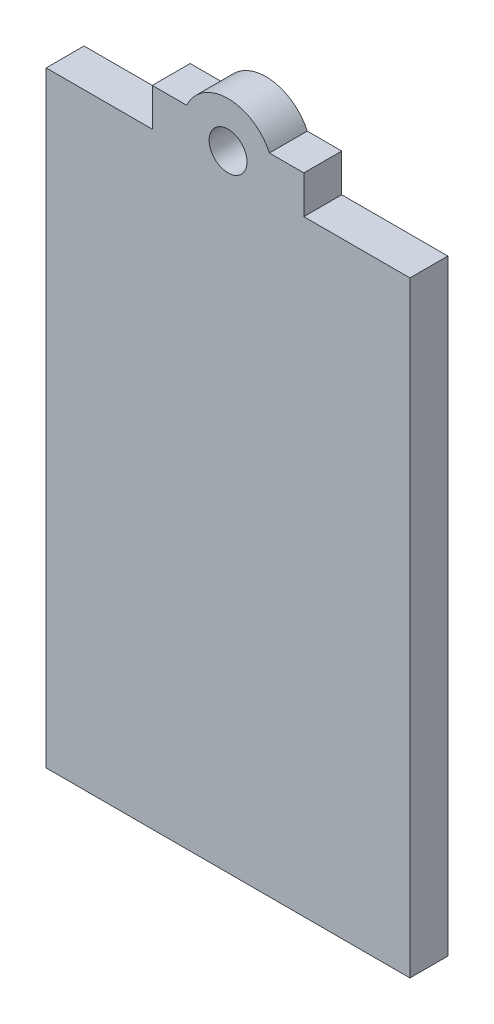
ISO-10303-21;
HEADER;
FILE_DESCRIPTION(('STEP AP214'),'2;1');
FILE_NAME('part.step','',(''),(''),'','','');
FILE_SCHEMA(('AUTOMOTIVE_DESIGN { 1 0 10303 214 1 1 1 1 }'));
ENDSEC;
DATA;
#1=APPLICATION_CONTEXT('core data for automotive mechanical design processes');
#2=APPLICATION_PROTOCOL_DEFINITION('international standard','automotive_design',2000,#1);
#3=PRODUCT_CONTEXT('',#1,'mechanical');
#4=PRODUCT('Part','Part','',(#3));
#5=PRODUCT_RELATED_PRODUCT_CATEGORY('part','',(#4));
#6=PRODUCT_DEFINITION_FORMATION('','',#4);
#7=PRODUCT_DEFINITION_CONTEXT('part definition',#1,'design');
#8=PRODUCT_DEFINITION('design','',#6,#7);
#9=PRODUCT_DEFINITION_SHAPE('','',#8);
#10=(LENGTH_UNIT() NAMED_UNIT(*) SI_UNIT(.MILLI.,.METRE.));
#11=(NAMED_UNIT(*) PLANE_ANGLE_UNIT() SI_UNIT($,.RADIAN.));
#12=(NAMED_UNIT(*) SI_UNIT($,.STERADIAN.) SOLID_ANGLE_UNIT());
#13=UNCERTAINTY_MEASURE_WITH_UNIT(LENGTH_MEASURE(1.E-05),#10,'distance_accuracy_value','');
#14=(GEOMETRIC_REPRESENTATION_CONTEXT(3) GLOBAL_UNCERTAINTY_ASSIGNED_CONTEXT((#13)) GLOBAL_UNIT_ASSIGNED_CONTEXT((#10,
#11,#12)) REPRESENTATION_CONTEXT('',''));
#15=CARTESIAN_POINT('',(0.,0.,0.));
#16=DIRECTION('',(0.,0.,1.));
#17=DIRECTION('',(1.,0.,0.));
#18=AXIS2_PLACEMENT_3D('',#15,#16,#17);
#19=CARTESIAN_POINT('',(0.,55.,0.));
#20=DIRECTION('',(0.,-1.,0.));
#21=DIRECTION('',(0.,0.,-1.));
#22=AXIS2_PLACEMENT_3D('',#19,#20,#21);
#23=PLANE('',#22);
#24=DIRECTION('',(-1.,0.,0.));
#25=VECTOR('',#24,1.);
#26=CARTESIAN_POINT('',(-10.,55.,0.));
#27=LINE('',#26,#25);
#28=CARTESIAN_POINT('',(9.99999999999999,55.,0.));
#29=VERTEX_POINT('',#28);
#30=CARTESIAN_POINT('',(5.45435605731786,55.,0.));
#31=VERTEX_POINT('',#30);
#32=EDGE_CURVE('E160',#29,#31,#27,.T.);
#33=ORIENTED_EDGE('',*,*,#32,.T.);
#34=DIRECTION('',(0.,0.,1.));
#35=VECTOR('',#34,1.);
#36=CARTESIAN_POINT('',(5.45435605731786,55.,0.));
#37=LINE('',#36,#35);
#38=CARTESIAN_POINT('',(5.45435605731786,55.,5.));
#39=VERTEX_POINT('',#38);
#40=EDGE_CURVE('E45',#31,#39,#37,.T.);
#41=ORIENTED_EDGE('',*,*,#40,.T.);
#42=DIRECTION('',(1.,0.,0.));
#43=VECTOR('',#42,1.);
#44=CARTESIAN_POINT('',(-10.,55.,5.));
#45=LINE('',#44,#43);
#46=CARTESIAN_POINT('',(9.99999999999999,55.,5.));
#47=VERTEX_POINT('',#46);
#48=EDGE_CURVE('E157',#39,#47,#45,.T.);
#49=ORIENTED_EDGE('',*,*,#48,.T.);
#50=DIRECTION('',(0.,0.,-1.));
#51=VECTOR('',#50,1.);
#52=CARTESIAN_POINT('',(9.99999999999999,55.,5.));
#53=LINE('',#52,#51);
#54=EDGE_CURVE('E183',#47,#29,#53,.T.);
#55=ORIENTED_EDGE('',*,*,#54,.T.);
#56=EDGE_LOOP('',(#33,#41,#49,#55));
#57=FACE_BOUND('',#56,.T.);
#58=ADVANCED_FACE('F37',(#57),#23,.F.);
#59=CARTESIAN_POINT('',(24.,50.,5.));
#60=DIRECTION('',(0.,-1.,0.));
#61=DIRECTION('',(1.,0.,0.));
#62=AXIS2_PLACEMENT_3D('',#59,#60,#61);
#63=PLANE('',#62);
#64=DIRECTION('',(0.,0.,1.));
#65=VECTOR('',#64,1.);
#66=CARTESIAN_POINT('',(-10.,50.,5.));
#67=LINE('',#66,#65);
#68=CARTESIAN_POINT('',(-10.,50.,0.));
#69=VERTEX_POINT('',#68);
#70=CARTESIAN_POINT('',(-10.,50.,5.));
#71=VERTEX_POINT('',#70);
#72=EDGE_CURVE('E170',#69,#71,#67,.T.);
#73=ORIENTED_EDGE('',*,*,#72,.F.);
#74=DIRECTION('',(-1.,0.,0.));
#75=VECTOR('',#74,1.);
#76=CARTESIAN_POINT('',(24.,50.,0.));
#77=LINE('',#76,#75);
#78=CARTESIAN_POINT('',(-24.,50.,0.));
#79=VERTEX_POINT('',#78);
#80=EDGE_CURVE('E136',#69,#79,#77,.T.);
#81=ORIENTED_EDGE('',*,*,#80,.T.);
#82=DIRECTION('',(0.,0.,-1.));
#83=VECTOR('',#82,1.);
#84=CARTESIAN_POINT('',(-24.,50.,5.));
#85=LINE('',#84,#83);
#86=CARTESIAN_POINT('',(-24.,50.,5.));
#87=VERTEX_POINT('',#86);
#88=EDGE_CURVE('E145',#87,#79,#85,.T.);
#89=ORIENTED_EDGE('',*,*,#88,.F.);
#90=DIRECTION('',(-1.,0.,0.));
#91=VECTOR('',#90,1.);
#92=CARTESIAN_POINT('',(24.,50.,5.));
#93=LINE('',#92,#91);
#94=EDGE_CURVE('E130',#71,#87,#93,.T.);
#95=ORIENTED_EDGE('',*,*,#94,.F.);
#96=EDGE_LOOP('',(#73,#81,#89,#95));
#97=FACE_BOUND('',#96,.T.);
#98=ADVANCED_FACE('F207',(#97),#63,.F.);
#99=DIRECTION('',(0.,0.,-1.));
#100=VECTOR('',#99,1.);
#101=CARTESIAN_POINT('',(9.99999999999999,50.,5.));
#102=LINE('',#101,#100);
#103=CARTESIAN_POINT('',(9.99999999999999,50.,5.));
#104=VERTEX_POINT('',#103);
#105=CARTESIAN_POINT('',(9.99999999999999,50.,0.));
#106=VERTEX_POINT('',#105);
#107=EDGE_CURVE('E180',#104,#106,#102,.T.);
#108=ORIENTED_EDGE('',*,*,#107,.F.);
#109=CARTESIAN_POINT('',(24.,50.,5.));
#110=VERTEX_POINT('',#109);
#111=EDGE_CURVE('E142',#110,#104,#93,.T.);
#112=ORIENTED_EDGE('',*,*,#111,.F.);
#113=DIRECTION('',(0.,0.,-1.));
#114=VECTOR('',#113,1.);
#115=CARTESIAN_POINT('',(24.,50.,5.));
#116=LINE('',#115,#114);
#117=CARTESIAN_POINT('',(24.,50.,0.));
#118=VERTEX_POINT('',#117);
#119=EDGE_CURVE('E150',#110,#118,#116,.T.);
#120=ORIENTED_EDGE('',*,*,#119,.T.);
#121=EDGE_CURVE('E133',#118,#106,#77,.T.);
#122=ORIENTED_EDGE('',*,*,#121,.T.);
#123=EDGE_LOOP('',(#108,#112,#120,#122));
#124=FACE_BOUND('',#123,.T.);
#125=ADVANCED_FACE('F235',(#124),#63,.F.);
#126=CARTESIAN_POINT('',(-24.,50.,5.));
#127=DIRECTION('',(1.,0.,0.));
#128=DIRECTION('',(0.,1.,0.));
#129=AXIS2_PLACEMENT_3D('',#126,#127,#128);
#130=PLANE('',#129);
#131=DIRECTION('',(0.,-1.,0.));
#132=VECTOR('',#131,1.);
#133=CARTESIAN_POINT('',(-24.,50.,0.));
#134=LINE('',#133,#132);
#135=CARTESIAN_POINT('',(-24.,-30.,0.));
#136=VERTEX_POINT('',#135);
#137=EDGE_CURVE('E125',#79,#136,#134,.T.);
#138=ORIENTED_EDGE('',*,*,#137,.T.);
#139=DIRECTION('',(0.,0.,1.));
#140=VECTOR('',#139,1.);
#141=CARTESIAN_POINT('',(-24.,-30.,-5.));
#142=LINE('',#141,#140);
#143=CARTESIAN_POINT('',(-24.,-30.,5.));
#144=VERTEX_POINT('',#143);
#145=EDGE_CURVE('E51',#136,#144,#142,.T.);
#146=ORIENTED_EDGE('',*,*,#145,.T.);
#147=DIRECTION('',(0.,-1.,0.));
#148=VECTOR('',#147,1.);
#149=CARTESIAN_POINT('',(-24.,50.,5.));
#150=LINE('',#149,#148);
#151=EDGE_CURVE('E123',#87,#144,#150,.T.);
#152=ORIENTED_EDGE('',*,*,#151,.F.);
#153=ORIENTED_EDGE('',*,*,#88,.T.);
#154=EDGE_LOOP('',(#138,#146,#152,#153));
#155=FACE_BOUND('',#154,.T.);
#156=ADVANCED_FACE('F39',(#155),#130,.F.);
#157=CARTESIAN_POINT('',(24.,50.,5.));
#158=DIRECTION('',(-1.,0.,0.));
#159=DIRECTION('',(0.,-1.,0.));
#160=AXIS2_PLACEMENT_3D('',#157,#158,#159);
#161=PLANE('',#160);
#162=DIRECTION('',(0.,1.,0.));
#163=VECTOR('',#162,1.);
#164=CARTESIAN_POINT('',(24.,50.,5.));
#165=LINE('',#164,#163);
#166=CARTESIAN_POINT('',(24.,-30.,5.));
#167=VERTEX_POINT('',#166);
#168=EDGE_CURVE('E132',#167,#110,#165,.T.);
#169=ORIENTED_EDGE('',*,*,#168,.F.);
#170=DIRECTION('',(0.,0.,-1.));
#171=VECTOR('',#170,1.);
#172=CARTESIAN_POINT('',(24.,-30.,5.));
#173=LINE('',#172,#171);
#174=CARTESIAN_POINT('',(24.,-30.,0.));
#175=VERTEX_POINT('',#174);
#176=EDGE_CURVE('E114',#167,#175,#173,.T.);
#177=ORIENTED_EDGE('',*,*,#176,.T.);
#178=DIRECTION('',(0.,1.,0.));
#179=VECTOR('',#178,1.);
#180=CARTESIAN_POINT('',(24.,50.,0.));
#181=LINE('',#180,#179);
#182=EDGE_CURVE('E147',#175,#118,#181,.T.);
#183=ORIENTED_EDGE('',*,*,#182,.T.);
#184=ORIENTED_EDGE('',*,*,#119,.F.);
#185=EDGE_LOOP('',(#169,#177,#183,#184));
#186=FACE_BOUND('',#185,.T.);
#187=ADVANCED_FACE('F214',(#186),#161,.F.);
#188=CARTESIAN_POINT('',(0.,0.,5.));
#189=DIRECTION('',(0.,0.,-1.));
#190=DIRECTION('',(-1.,0.,0.));
#191=AXIS2_PLACEMENT_3D('',#188,#189,#190);
#192=PLANE('',#191);
#193=ORIENTED_EDGE('',*,*,#151,.T.);
#194=DIRECTION('',(-1.,0.,0.));
#195=VECTOR('',#194,1.);
#196=CARTESIAN_POINT('',(-24.,-30.,5.));
#197=LINE('',#196,#195);
#198=EDGE_CURVE('E111',#167,#144,#197,.T.);
#199=ORIENTED_EDGE('',*,*,#198,.F.);
#200=ORIENTED_EDGE('',*,*,#168,.T.);
#201=ORIENTED_EDGE('',*,*,#111,.T.);
#202=DIRECTION('',(0.,-1.,0.));
#203=VECTOR('',#202,1.);
#204=CARTESIAN_POINT('',(9.99999999999999,55.,5.));
#205=LINE('',#204,#203);
#206=EDGE_CURVE('E196',#47,#104,#205,.T.);
#207=ORIENTED_EDGE('',*,*,#206,.F.);
#208=ORIENTED_EDGE('',*,*,#48,.F.);
#209=CARTESIAN_POINT('',(0.,52.5,5.));
#210=DIRECTION('',(0.,0.,1.));
#211=DIRECTION('',(1.,0.,0.));
#212=AXIS2_PLACEMENT_3D('',#209,#210,#211);
#213=CIRCLE('',#212,6.);
#214=CARTESIAN_POINT('',(-5.45435605731785,55.,5.));
#215=VERTEX_POINT('',#214);
#216=EDGE_CURVE('E165',#39,#215,#213,.T.);
#217=ORIENTED_EDGE('',*,*,#216,.T.);
#218=CARTESIAN_POINT('',(-10.,55.,5.));
#219=VERTEX_POINT('',#218);
#220=EDGE_CURVE('E181',#219,#215,#45,.T.);
#221=ORIENTED_EDGE('',*,*,#220,.F.);
#222=DIRECTION('',(0.,-1.,0.));
#223=VECTOR('',#222,1.);
#224=CARTESIAN_POINT('',(-10.,55.,5.));
#225=LINE('',#224,#223);
#226=EDGE_CURVE('E139',#219,#71,#225,.T.);
#227=ORIENTED_EDGE('',*,*,#226,.T.);
#228=ORIENTED_EDGE('',*,*,#94,.T.);
#229=EDGE_LOOP('',(#193,#199,#200,#201,#207,#208,#217,#221,#227,#228));
#230=FACE_BOUND('',#229,.T.);
#231=CARTESIAN_POINT('',(0.,52.5,5.));
#232=DIRECTION('',(0.,0.,1.));
#233=DIRECTION('',(1.,0.,0.));
#234=AXIS2_PLACEMENT_3D('',#231,#232,#233);
#235=CIRCLE('',#234,2.5);
#236=CARTESIAN_POINT('',(2.50000000000001,52.5,5.));
#237=VERTEX_POINT('',#236);
#238=EDGE_CURVE('E173',#237,#237,#235,.T.);
#239=ORIENTED_EDGE('',*,*,#238,.F.);
#240=EDGE_LOOP('',(#239));
#241=FACE_BOUND('',#240,.T.);
#242=ADVANCED_FACE('F127',(#230,#241),#192,.F.);
#243=CARTESIAN_POINT('',(0.,0.,0.));
#244=DIRECTION('',(0.,0.,-1.));
#245=DIRECTION('',(-1.,0.,0.));
#246=AXIS2_PLACEMENT_3D('',#243,#244,#245);
#247=PLANE('',#246);
#248=DIRECTION('',(1.,0.,0.));
#249=VECTOR('',#248,1.);
#250=CARTESIAN_POINT('',(0.,-30.,0.));
#251=LINE('',#250,#249);
#252=EDGE_CURVE('E11',#136,#175,#251,.T.);
#253=ORIENTED_EDGE('',*,*,#252,.F.);
#254=ORIENTED_EDGE('',*,*,#137,.F.);
#255=ORIENTED_EDGE('',*,*,#80,.F.);
#256=DIRECTION('',(0.,-1.,0.));
#257=VECTOR('',#256,1.);
#258=CARTESIAN_POINT('',(-10.,55.,0.));
#259=LINE('',#258,#257);
#260=CARTESIAN_POINT('',(-10.,55.,0.));
#261=VERTEX_POINT('',#260);
#262=EDGE_CURVE('E187',#261,#69,#259,.T.);
#263=ORIENTED_EDGE('',*,*,#262,.F.);
#264=CARTESIAN_POINT('',(-5.45435605731785,55.,0.));
#265=VERTEX_POINT('',#264);
#266=EDGE_CURVE('E185',#265,#261,#27,.T.);
#267=ORIENTED_EDGE('',*,*,#266,.F.);
#268=CARTESIAN_POINT('',(0.,52.5,0.));
#269=DIRECTION('',(0.,0.,1.));
#270=DIRECTION('',(1.,0.,0.));
#271=AXIS2_PLACEMENT_3D('',#268,#269,#270);
#272=CIRCLE('',#271,6.);
#273=EDGE_CURVE('E167',#31,#265,#272,.T.);
#274=ORIENTED_EDGE('',*,*,#273,.F.);
#275=ORIENTED_EDGE('',*,*,#32,.F.);
#276=DIRECTION('',(0.,-1.,0.));
#277=VECTOR('',#276,1.);
#278=CARTESIAN_POINT('',(9.99999999999999,55.,0.));
#279=LINE('',#278,#277);
#280=EDGE_CURVE('E194',#29,#106,#279,.T.);
#281=ORIENTED_EDGE('',*,*,#280,.T.);
#282=ORIENTED_EDGE('',*,*,#121,.F.);
#283=ORIENTED_EDGE('',*,*,#182,.F.);
#284=EDGE_LOOP('',(#253,#254,#255,#263,#267,#274,#275,#281,#282,#283));
#285=FACE_BOUND('',#284,.T.);
#286=CARTESIAN_POINT('',(0.,52.5,0.));
#287=DIRECTION('',(0.,0.,1.));
#288=DIRECTION('',(1.,0.,0.));
#289=AXIS2_PLACEMENT_3D('',#286,#287,#288);
#290=CIRCLE('',#289,2.5);
#291=CARTESIAN_POINT('',(2.50000000000001,52.5,0.));
#292=VERTEX_POINT('',#291);
#293=EDGE_CURVE('E168',#292,#292,#290,.T.);
#294=ORIENTED_EDGE('',*,*,#293,.T.);
#295=EDGE_LOOP('',(#294));
#296=FACE_BOUND('',#295,.T.);
#297=ADVANCED_FACE('F209',(#285,#296),#247,.T.);
#298=CARTESIAN_POINT('',(-10.,55.,5.));
#299=DIRECTION('',(1.,0.,0.));
#300=DIRECTION('',(0.,0.,-1.));
#301=AXIS2_PLACEMENT_3D('',#298,#299,#300);
#302=PLANE('',#301);
#303=ORIENTED_EDGE('',*,*,#72,.T.);
#304=ORIENTED_EDGE('',*,*,#226,.F.);
#305=DIRECTION('',(0.,0.,1.));
#306=VECTOR('',#305,1.);
#307=CARTESIAN_POINT('',(-10.,55.,5.));
#308=LINE('',#307,#306);
#309=EDGE_CURVE('E177',#261,#219,#308,.T.);
#310=ORIENTED_EDGE('',*,*,#309,.F.);
#311=ORIENTED_EDGE('',*,*,#262,.T.);
#312=EDGE_LOOP('',(#303,#304,#310,#311));
#313=FACE_BOUND('',#312,.T.);
#314=ADVANCED_FACE('F203',(#313),#302,.F.);
#315=CARTESIAN_POINT('',(9.99999999999999,55.,5.));
#316=DIRECTION('',(-1.,0.,0.));
#317=DIRECTION('',(0.,0.,1.));
#318=AXIS2_PLACEMENT_3D('',#315,#316,#317);
#319=PLANE('',#318);
#320=ORIENTED_EDGE('',*,*,#107,.T.);
#321=ORIENTED_EDGE('',*,*,#280,.F.);
#322=ORIENTED_EDGE('',*,*,#54,.F.);
#323=ORIENTED_EDGE('',*,*,#206,.T.);
#324=EDGE_LOOP('',(#320,#321,#322,#323));
#325=FACE_BOUND('',#324,.T.);
#326=ADVANCED_FACE('F240',(#325),#319,.F.);
#327=ORIENTED_EDGE('',*,*,#220,.T.);
#328=DIRECTION('',(0.,0.,1.));
#329=VECTOR('',#328,1.);
#330=CARTESIAN_POINT('',(-5.45435605731785,55.,0.));
#331=LINE('',#330,#329);
#332=EDGE_CURVE('E59',#215,#265,#331,.F.);
#333=ORIENTED_EDGE('',*,*,#332,.T.);
#334=ORIENTED_EDGE('',*,*,#266,.T.);
#335=ORIENTED_EDGE('',*,*,#309,.T.);
#336=EDGE_LOOP('',(#327,#333,#334,#335));
#337=FACE_BOUND('',#336,.T.);
#338=ADVANCED_FACE('F231',(#337),#23,.F.);
#339=CARTESIAN_POINT('',(0.,52.5,0.));
#340=DIRECTION('',(0.,0.,1.));
#341=DIRECTION('',(1.,0.,0.));
#342=AXIS2_PLACEMENT_3D('',#339,#340,#341);
#343=CYLINDRICAL_SURFACE('',#342,6.);
#344=ORIENTED_EDGE('',*,*,#40,.F.);
#345=ORIENTED_EDGE('',*,*,#273,.T.);
#346=ORIENTED_EDGE('',*,*,#332,.F.);
#347=ORIENTED_EDGE('',*,*,#216,.F.);
#348=EDGE_LOOP('',(#344,#345,#346,#347));
#349=FACE_BOUND('',#348,.T.);
#350=ADVANCED_FACE('F166',(#349),#343,.T.);
#351=CARTESIAN_POINT('',(0.,52.5,0.));
#352=DIRECTION('',(0.,0.,1.));
#353=DIRECTION('',(1.,0.,0.));
#354=AXIS2_PLACEMENT_3D('',#351,#352,#353);
#355=CYLINDRICAL_SURFACE('',#354,2.5);
#356=ORIENTED_EDGE('',*,*,#293,.F.);
#357=EDGE_LOOP('',(#356));
#358=FACE_BOUND('',#357,.T.);
#359=ORIENTED_EDGE('',*,*,#238,.T.);
#360=EDGE_LOOP('',(#359));
#361=FACE_BOUND('',#360,.T.);
#362=ADVANCED_FACE('F220',(#358,#361),#355,.F.);
#363=CARTESIAN_POINT('',(-24.,-30.,-5.));
#364=DIRECTION('',(0.,1.,0.));
#365=DIRECTION('',(0.,0.,1.));
#366=AXIS2_PLACEMENT_3D('',#363,#364,#365);
#367=PLANE('',#366);
#368=ORIENTED_EDGE('',*,*,#198,.T.);
#369=ORIENTED_EDGE('',*,*,#145,.F.);
#370=ORIENTED_EDGE('',*,*,#252,.T.);
#371=ORIENTED_EDGE('',*,*,#176,.F.);
#372=EDGE_LOOP('',(#368,#369,#370,#371));
#373=FACE_BOUND('',#372,.T.);
#374=ADVANCED_FACE('F112',(#373),#367,.F.);
#375=CLOSED_SHELL('',(#58,#98,#125,#156,#187,#242,#297,#314,#326,#338,#350,#362,#374));
#376=MANIFOLD_SOLID_BREP('B2',#375);
#377=ADVANCED_BREP_SHAPE_REPRESENTATION('',(#18,#376),#14);
#378=SHAPE_DEFINITION_REPRESENTATION(#9,#377);
ENDSEC;
END-ISO-10303-21;
